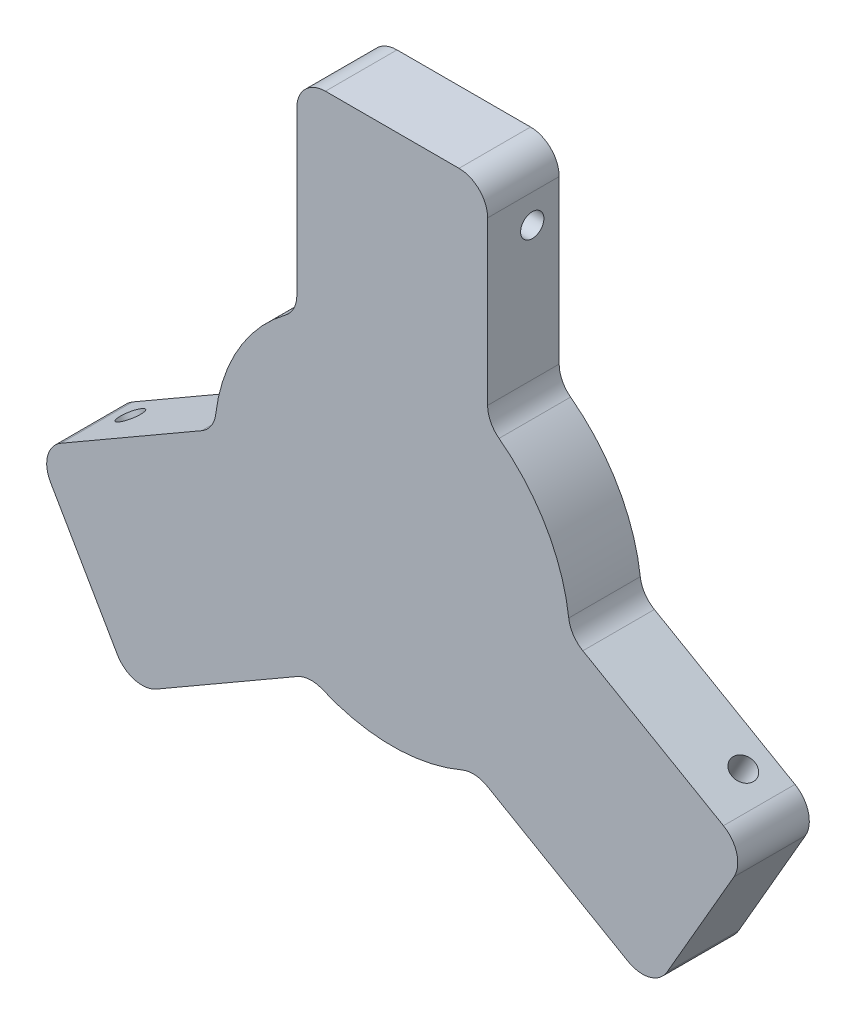
ISO-10303-21;
HEADER;
FILE_DESCRIPTION(('STEP AP214'),'2;1');
FILE_NAME('part.step','',(''),(''),'','','');
FILE_SCHEMA(('AUTOMOTIVE_DESIGN { 1 0 10303 214 1 1 1 1 }'));
ENDSEC;
DATA;
#1=APPLICATION_CONTEXT('core data for automotive mechanical design processes');
#2=APPLICATION_PROTOCOL_DEFINITION('international standard','automotive_design',2000,#1);
#3=PRODUCT_CONTEXT('',#1,'mechanical');
#4=PRODUCT('Part','Part','',(#3));
#5=PRODUCT_RELATED_PRODUCT_CATEGORY('part','',(#4));
#6=PRODUCT_DEFINITION_FORMATION('','',#4);
#7=PRODUCT_DEFINITION_CONTEXT('part definition',#1,'design');
#8=PRODUCT_DEFINITION('design','',#6,#7);
#9=PRODUCT_DEFINITION_SHAPE('','',#8);
#10=(LENGTH_UNIT() NAMED_UNIT(*) SI_UNIT(.MILLI.,.METRE.));
#11=(NAMED_UNIT(*) PLANE_ANGLE_UNIT() SI_UNIT($,.RADIAN.));
#12=(NAMED_UNIT(*) SI_UNIT($,.STERADIAN.) SOLID_ANGLE_UNIT());
#13=UNCERTAINTY_MEASURE_WITH_UNIT(LENGTH_MEASURE(1.E-05),#10,'distance_accuracy_value','');
#14=(GEOMETRIC_REPRESENTATION_CONTEXT(3) GLOBAL_UNCERTAINTY_ASSIGNED_CONTEXT((#13)) GLOBAL_UNIT_ASSIGNED_CONTEXT((#10,
#11,#12)) REPRESENTATION_CONTEXT('',''));
#15=CARTESIAN_POINT('',(0.,0.,0.));
#16=DIRECTION('',(0.,0.,1.));
#17=DIRECTION('',(1.,0.,0.));
#18=AXIS2_PLACEMENT_3D('',#15,#16,#17);
#19=CARTESIAN_POINT('',(-16.51,21.96907979331,9.525));
#20=DIRECTION('',(0.,0.,-1.));
#21=DIRECTION('',(-1.,0.,0.));
#22=AXIS2_PLACEMENT_3D('',#19,#20,#21);
#23=CYLINDRICAL_SURFACE('',#22,3.81);
#24=CARTESIAN_POINT('',(-16.51,21.96907979331,0.));
#25=DIRECTION('',(0.,0.,-1.));
#26=DIRECTION('',(-1.,0.,0.));
#27=AXIS2_PLACEMENT_3D('',#24,#25,#26);
#28=CIRCLE('',#27,3.81);
#29=CARTESIAN_POINT('',(-12.7,21.96907979331,0.));
#30=VERTEX_POINT('',#29);
#31=CARTESIAN_POINT('',(-14.2210561210812,18.9232899254496,0.));
#32=VERTEX_POINT('',#31);
#33=EDGE_CURVE('E227',#30,#32,#28,.T.);
#34=ORIENTED_EDGE('',*,*,#33,.T.);
#35=DIRECTION('',(0.,0.,-1.));
#36=VECTOR('',#35,1.);
#37=CARTESIAN_POINT('',(-14.2210561210812,18.9232899254496,9.525));
#38=LINE('',#37,#36);
#39=CARTESIAN_POINT('',(-14.2210561210812,18.9232899254496,9.525));
#40=VERTEX_POINT('',#39);
#41=EDGE_CURVE('E11',#40,#32,#38,.T.);
#42=ORIENTED_EDGE('',*,*,#41,.F.);
#43=CARTESIAN_POINT('',(-16.51,21.96907979331,9.525));
#44=DIRECTION('',(0.,0.,-1.));
#45=DIRECTION('',(-1.,0.,0.));
#46=AXIS2_PLACEMENT_3D('',#43,#44,#45);
#47=CIRCLE('',#46,3.81);
#48=CARTESIAN_POINT('',(-12.7,21.96907979331,9.525));
#49=VERTEX_POINT('',#48);
#50=EDGE_CURVE('E274',#49,#40,#47,.T.);
#51=ORIENTED_EDGE('',*,*,#50,.F.);
#52=DIRECTION('',(0.,0.,-1.));
#53=VECTOR('',#52,1.);
#54=CARTESIAN_POINT('',(-12.7,21.96907979331,9.525));
#55=LINE('',#54,#53);
#56=EDGE_CURVE('E223',#49,#30,#55,.T.);
#57=ORIENTED_EDGE('',*,*,#56,.T.);
#58=EDGE_LOOP('',(#34,#42,#51,#57));
#59=FACE_BOUND('',#58,.T.);
#60=ADVANCED_FACE('F35',(#59),#23,.F.);
#61=CARTESIAN_POINT('',(0.,0.,9.525));
#62=DIRECTION('',(0.,0.,-1.));
#63=DIRECTION('',(-1.,0.,0.));
#64=AXIS2_PLACEMENT_3D('',#61,#62,#63);
#65=CYLINDRICAL_SURFACE('',#64,23.6712766618441);
#66=CARTESIAN_POINT('',(0.,0.,0.));
#67=DIRECTION('',(0.,0.,1.));
#68=DIRECTION('',(1.,0.,0.));
#69=AXIS2_PLACEMENT_3D('',#66,#67,#68);
#70=CIRCLE('',#69,23.6712766618441);
#71=CARTESIAN_POINT('',(-23.4985778591582,2.85415090677404,0.));
#72=VERTEX_POINT('',#71);
#73=EDGE_CURVE('E230',#32,#72,#70,.T.);
#74=ORIENTED_EDGE('',*,*,#73,.T.);
#75=DIRECTION('',(0.,0.,-1.));
#76=VECTOR('',#75,1.);
#77=CARTESIAN_POINT('',(-23.4985778591582,2.85415090677404,9.525));
#78=LINE('',#77,#76);
#79=CARTESIAN_POINT('',(-23.4985778591582,2.85415090677404,9.525));
#80=VERTEX_POINT('',#79);
#81=EDGE_CURVE('E43',#80,#72,#78,.T.);
#82=ORIENTED_EDGE('',*,*,#81,.F.);
#83=CARTESIAN_POINT('',(0.,0.,9.525));
#84=DIRECTION('',(0.,0.,1.));
#85=DIRECTION('',(1.,0.,0.));
#86=AXIS2_PLACEMENT_3D('',#83,#84,#85);
#87=CIRCLE('',#86,23.6712766618441);
#88=EDGE_CURVE('E142',#40,#80,#87,.T.);
#89=ORIENTED_EDGE('',*,*,#88,.F.);
#90=ORIENTED_EDGE('',*,*,#41,.T.);
#91=EDGE_LOOP('',(#74,#82,#89,#90));
#92=FACE_BOUND('',#91,.T.);
#93=ADVANCED_FACE('F414',(#92),#65,.T.);
#94=CARTESIAN_POINT('',(-27.2807811987738,3.31353951982411,9.525));
#95=DIRECTION('',(0.,0.,-1.));
#96=DIRECTION('',(-1.,0.,0.));
#97=AXIS2_PLACEMENT_3D('',#94,#95,#96);
#98=CYLINDRICAL_SURFACE('',#97,3.81);
#99=CARTESIAN_POINT('',(-27.2807811987738,3.31353951982411,0.));
#100=DIRECTION('',(0.,0.,-1.));
#101=DIRECTION('',(1.,0.,0.));
#102=AXIS2_PLACEMENT_3D('',#99,#100,#101);
#103=CIRCLE('',#102,3.81);
#104=CARTESIAN_POINT('',(-25.3757811987738,0.0139827314054003,0.));
#105=VERTEX_POINT('',#104);
#106=EDGE_CURVE('E233',#72,#105,#103,.T.);
#107=ORIENTED_EDGE('',*,*,#106,.T.);
#108=DIRECTION('',(0.,0.,-1.));
#109=VECTOR('',#108,1.);
#110=CARTESIAN_POINT('',(-25.3757811987738,0.0139827314054003,9.525));
#111=LINE('',#110,#109);
#112=CARTESIAN_POINT('',(-25.3757811987738,0.0139827314054003,9.525));
#113=VERTEX_POINT('',#112);
#114=EDGE_CURVE('E329',#113,#105,#111,.T.);
#115=ORIENTED_EDGE('',*,*,#114,.F.);
#116=CARTESIAN_POINT('',(-27.2807811987738,3.31353951982411,9.525));
#117=DIRECTION('',(0.,0.,-1.));
#118=DIRECTION('',(1.,0.,0.));
#119=AXIS2_PLACEMENT_3D('',#116,#117,#118);
#120=CIRCLE('',#119,3.81);
#121=EDGE_CURVE('E337',#80,#113,#120,.T.);
#122=ORIENTED_EDGE('',*,*,#121,.F.);
#123=ORIENTED_EDGE('',*,*,#81,.T.);
#124=EDGE_LOOP('',(#107,#115,#122,#123));
#125=FACE_BOUND('',#124,.T.);
#126=ADVANCED_FACE('F335',(#125),#98,.F.);
#127=CARTESIAN_POINT('',(-25.3757811987738,0.0139827314054003,9.525));
#128=DIRECTION('',(0.5,-0.866025403784439,0.));
#129=DIRECTION('',(0.866025403784439,0.5,0.));
#130=AXIS2_PLACEMENT_3D('',#127,#128,#129);
#131=PLANE('',#130);
#132=CARTESIAN_POINT('',(-40.7973728710933,-8.88967737193932,3.58200000000159));
#133=DIRECTION('',(-0.500000000000029,0.866025403784422,0.));
#134=DIRECTION('',(-0.866025403784422,-0.500000000000029,0.));
#135=AXIS2_PLACEMENT_3D('',#132,#133,#134);
#136=CIRCLE('',#135,1.54999999999965);
#137=CARTESIAN_POINT('',(-42.1397122469589,-9.66467737193919,3.58200000000159));
#138=VERTEX_POINT('',#137);
#139=EDGE_CURVE('E697',#138,#138,#136,.T.);
#140=ORIENTED_EDGE('',*,*,#139,.F.);
#141=EDGE_LOOP('',(#140));
#142=FACE_BOUND('',#141,.T.);
#143=DIRECTION('',(-0.866025403784439,-0.5,0.));
#144=VECTOR('',#143,1.);
#145=CARTESIAN_POINT('',(-25.3757811987738,0.0139827314054003,0.));
#146=LINE('',#145,#144);
#147=CARTESIAN_POINT('',(-44.0969296595093,-10.7946773719391,0.));
#148=VERTEX_POINT('',#147);
#149=EDGE_CURVE('E235',#105,#148,#146,.T.);
#150=ORIENTED_EDGE('',*,*,#149,.T.);
#151=DIRECTION('',(0.,0.,-1.));
#152=VECTOR('',#151,1.);
#153=CARTESIAN_POINT('',(-44.0969296595093,-10.7946773719391,9.525));
#154=LINE('',#153,#152);
#155=CARTESIAN_POINT('',(-44.0969296595093,-10.7946773719391,9.525));
#156=VERTEX_POINT('',#155);
#157=EDGE_CURVE('E326',#156,#148,#154,.T.);
#158=ORIENTED_EDGE('',*,*,#157,.F.);
#159=DIRECTION('',(-0.866025403784439,-0.5,0.));
#160=VECTOR('',#159,1.);
#161=CARTESIAN_POINT('',(-25.3757811987738,0.0139827314054003,9.525));
#162=LINE('',#161,#160);
#163=EDGE_CURVE('E355',#113,#156,#162,.T.);
#164=ORIENTED_EDGE('',*,*,#163,.F.);
#165=ORIENTED_EDGE('',*,*,#114,.T.);
#166=EDGE_LOOP('',(#150,#158,#164,#165));
#167=FACE_BOUND('',#166,.T.);
#168=ADVANCED_FACE('F346',(#142,#167),#131,.F.);
#169=CARTESIAN_POINT('',(-42.1919296595093,-14.0942341603579,9.525));
#170=DIRECTION('',(0.,0.,-1.));
#171=DIRECTION('',(-1.,0.,0.));
#172=AXIS2_PLACEMENT_3D('',#169,#170,#171);
#173=CYLINDRICAL_SURFACE('',#172,3.81);
#174=CARTESIAN_POINT('',(-42.1919296595093,-14.0942341603579,0.));
#175=DIRECTION('',(0.,0.,1.));
#176=DIRECTION('',(1.,0.,0.));
#177=AXIS2_PLACEMENT_3D('',#174,#175,#176);
#178=CIRCLE('',#177,3.81);
#179=CARTESIAN_POINT('',(-45.491486447928,-15.9992341603579,0.));
#180=VERTEX_POINT('',#179);
#181=EDGE_CURVE('E237',#148,#180,#178,.T.);
#182=ORIENTED_EDGE('',*,*,#181,.T.);
#183=DIRECTION('',(0.,0.,-1.));
#184=VECTOR('',#183,1.);
#185=CARTESIAN_POINT('',(-45.491486447928,-15.9992341603579,9.525));
#186=LINE('',#185,#184);
#187=CARTESIAN_POINT('',(-45.491486447928,-15.9992341603579,9.525));
#188=VERTEX_POINT('',#187);
#189=EDGE_CURVE('E323',#188,#180,#186,.T.);
#190=ORIENTED_EDGE('',*,*,#189,.F.);
#191=CARTESIAN_POINT('',(-42.1919296595093,-14.0942341603579,9.525));
#192=DIRECTION('',(0.,0.,1.));
#193=DIRECTION('',(1.,0.,0.));
#194=AXIS2_PLACEMENT_3D('',#191,#192,#193);
#195=CIRCLE('',#194,3.81);
#196=EDGE_CURVE('E352',#156,#188,#195,.T.);
#197=ORIENTED_EDGE('',*,*,#196,.F.);
#198=ORIENTED_EDGE('',*,*,#157,.T.);
#199=EDGE_LOOP('',(#182,#190,#197,#198));
#200=FACE_BOUND('',#199,.T.);
#201=ADVANCED_FACE('F350',(#200),#173,.T.);
#202=CARTESIAN_POINT('',(-45.491486447928,-15.9992341603579,9.525));
#203=DIRECTION('',(0.866025403784438,0.5,0.));
#204=DIRECTION('',(-0.5,0.866025403784438,0.));
#205=AXIS2_PLACEMENT_3D('',#202,#203,#204);
#206=PLANE('',#205);
#207=DIRECTION('',(0.5,-0.866025403784438,0.));
#208=VECTOR('',#207,1.);
#209=CARTESIAN_POINT('',(-45.491486447928,-15.9992341603579,0.));
#210=LINE('',#209,#208);
#211=CARTESIAN_POINT('',(-36.601486447928,-31.3971658396452,0.));
#212=VERTEX_POINT('',#211);
#213=EDGE_CURVE('E239',#180,#212,#210,.T.);
#214=ORIENTED_EDGE('',*,*,#213,.T.);
#215=DIRECTION('',(0.,0.,-1.));
#216=VECTOR('',#215,1.);
#217=CARTESIAN_POINT('',(-36.601486447928,-31.3971658396452,9.525));
#218=LINE('',#217,#216);
#219=CARTESIAN_POINT('',(-36.601486447928,-31.3971658396452,9.525));
#220=VERTEX_POINT('',#219);
#221=EDGE_CURVE('E320',#220,#212,#218,.T.);
#222=ORIENTED_EDGE('',*,*,#221,.F.);
#223=DIRECTION('',(0.5,-0.866025403784438,0.));
#224=VECTOR('',#223,1.);
#225=CARTESIAN_POINT('',(-45.491486447928,-15.9992341603579,9.525));
#226=LINE('',#225,#224);
#227=EDGE_CURVE('E354',#188,#220,#226,.T.);
#228=ORIENTED_EDGE('',*,*,#227,.F.);
#229=ORIENTED_EDGE('',*,*,#189,.T.);
#230=EDGE_LOOP('',(#214,#222,#228,#229));
#231=FACE_BOUND('',#230,.T.);
#232=ADVANCED_FACE('F428',(#231),#206,.F.);
#233=CARTESIAN_POINT('',(-33.3019296595093,-29.4921658396452,9.525));
#234=DIRECTION('',(0.,0.,-1.));
#235=DIRECTION('',(-1.,0.,0.));
#236=AXIS2_PLACEMENT_3D('',#233,#234,#235);
#237=CYLINDRICAL_SURFACE('',#236,3.81);
#238=CARTESIAN_POINT('',(-33.3019296595093,-29.4921658396452,0.));
#239=DIRECTION('',(0.,0.,1.));
#240=DIRECTION('',(-1.,0.,0.));
#241=AXIS2_PLACEMENT_3D('',#238,#239,#240);
#242=CIRCLE('',#241,3.81);
#243=CARTESIAN_POINT('',(-31.3969296595093,-32.7917226280639,0.));
#244=VERTEX_POINT('',#243);
#245=EDGE_CURVE('E241',#212,#244,#242,.T.);
#246=ORIENTED_EDGE('',*,*,#245,.T.);
#247=DIRECTION('',(0.,0.,-1.));
#248=VECTOR('',#247,1.);
#249=CARTESIAN_POINT('',(-31.3969296595093,-32.7917226280639,9.525));
#250=LINE('',#249,#248);
#251=CARTESIAN_POINT('',(-31.3969296595093,-32.7917226280639,9.525));
#252=VERTEX_POINT('',#251);
#253=EDGE_CURVE('E317',#252,#244,#250,.T.);
#254=ORIENTED_EDGE('',*,*,#253,.F.);
#255=CARTESIAN_POINT('',(-33.3019296595093,-29.4921658396452,9.525));
#256=DIRECTION('',(0.,0.,1.));
#257=DIRECTION('',(-1.,0.,0.));
#258=AXIS2_PLACEMENT_3D('',#255,#256,#257);
#259=CIRCLE('',#258,3.81);
#260=EDGE_CURVE('E357',#220,#252,#259,.T.);
#261=ORIENTED_EDGE('',*,*,#260,.F.);
#262=ORIENTED_EDGE('',*,*,#221,.T.);
#263=EDGE_LOOP('',(#246,#254,#261,#262));
#264=FACE_BOUND('',#263,.T.);
#265=ADVANCED_FACE('F431',(#264),#237,.T.);
#266=CARTESIAN_POINT('',(-12.6757811987716,-21.9830625247181,9.525));
#267=DIRECTION('',(-0.5,0.866025403784439,0.));
#268=DIRECTION('',(-0.866025403784439,-0.5,0.));
#269=AXIS2_PLACEMENT_3D('',#266,#267,#268);
#270=PLANE('',#269);
#271=CARTESIAN_POINT('',(-28.0973728710923,-30.8867226280636,3.58200000000159));
#272=DIRECTION('',(0.499999999999996,-0.866025403784441,0.));
#273=DIRECTION('',(0.866025403784441,0.499999999999996,0.));
#274=AXIS2_PLACEMENT_3D('',#271,#272,#273);
#275=CIRCLE('',#274,1.55000000000059);
#276=CARTESIAN_POINT('',(-26.7550334952259,-30.1117226280634,3.58200000000159));
#277=VERTEX_POINT('',#276);
#278=EDGE_CURVE('E682',#277,#277,#275,.T.);
#279=ORIENTED_EDGE('',*,*,#278,.F.);
#280=EDGE_LOOP('',(#279));
#281=FACE_BOUND('',#280,.T.);
#282=DIRECTION('',(0.866025403784439,0.5,0.));
#283=VECTOR('',#282,1.);
#284=CARTESIAN_POINT('',(-12.6757811987716,-21.9830625247181,0.));
#285=LINE('',#284,#283);
#286=CARTESIAN_POINT('',(-12.6757811987716,-21.9830625247181,0.));
#287=VERTEX_POINT('',#286);
#288=EDGE_CURVE('E243',#244,#287,#285,.T.);
#289=ORIENTED_EDGE('',*,*,#288,.T.);
#290=DIRECTION('',(0.,0.,-1.));
#291=VECTOR('',#290,1.);
#292=CARTESIAN_POINT('',(-12.6757811987716,-21.9830625247181,9.525));
#293=LINE('',#292,#291);
#294=CARTESIAN_POINT('',(-12.6757811987716,-21.9830625247181,9.525));
#295=VERTEX_POINT('',#294);
#296=EDGE_CURVE('E314',#295,#287,#293,.T.);
#297=ORIENTED_EDGE('',*,*,#296,.F.);
#298=DIRECTION('',(0.866025403784439,0.5,0.));
#299=VECTOR('',#298,1.);
#300=CARTESIAN_POINT('',(-12.6757811987716,-21.9830625247181,9.525));
#301=LINE('',#300,#299);
#302=EDGE_CURVE('E363',#252,#295,#301,.T.);
#303=ORIENTED_EDGE('',*,*,#302,.F.);
#304=ORIENTED_EDGE('',*,*,#253,.T.);
#305=EDGE_LOOP('',(#289,#297,#303,#304));
#306=FACE_BOUND('',#305,.T.);
#307=ADVANCED_FACE('F435',(#281,#306),#270,.F.);
#308=CARTESIAN_POINT('',(-10.7707811987716,-25.2826193131368,9.525));
#309=DIRECTION('',(0.,0.,-1.));
#310=DIRECTION('',(-1.,0.,0.));
#311=AXIS2_PLACEMENT_3D('',#308,#309,#310);
#312=CYLINDRICAL_SURFACE('',#311,3.81);
#313=CARTESIAN_POINT('',(-10.7707811987716,-25.2826193131368,0.));
#314=DIRECTION('',(0.,0.,-1.));
#315=DIRECTION('',(-1.,0.,0.));
#316=AXIS2_PLACEMENT_3D('',#313,#314,#315);
#317=CIRCLE('',#316,3.81);
#318=CARTESIAN_POINT('',(-9.27752173807504,-21.7774408322261,0.));
#319=VERTEX_POINT('',#318);
#320=EDGE_CURVE('E245',#287,#319,#317,.T.);
#321=ORIENTED_EDGE('',*,*,#320,.T.);
#322=DIRECTION('',(0.,0.,-1.));
#323=VECTOR('',#322,1.);
#324=CARTESIAN_POINT('',(-9.27752173807504,-21.7774408322261,9.525));
#325=LINE('',#324,#323);
#326=CARTESIAN_POINT('',(-9.27752173807504,-21.7774408322261,9.525));
#327=VERTEX_POINT('',#326);
#328=EDGE_CURVE('E311',#327,#319,#325,.T.);
#329=ORIENTED_EDGE('',*,*,#328,.F.);
#330=CARTESIAN_POINT('',(-10.7707811987716,-25.2826193131368,9.525));
#331=DIRECTION('',(0.,0.,-1.));
#332=DIRECTION('',(-1.,0.,0.));
#333=AXIS2_PLACEMENT_3D('',#330,#331,#332);
#334=CIRCLE('',#333,3.81);
#335=EDGE_CURVE('E365',#295,#327,#334,.T.);
#336=ORIENTED_EDGE('',*,*,#335,.F.);
#337=ORIENTED_EDGE('',*,*,#296,.T.);
#338=EDGE_LOOP('',(#321,#329,#336,#337));
#339=FACE_BOUND('',#338,.T.);
#340=ADVANCED_FACE('F439',(#339),#312,.F.);
#341=CARTESIAN_POINT('',(0.,0.,9.525));
#342=DIRECTION('',(0.,0.,-1.));
#343=DIRECTION('',(-1.,0.,0.));
#344=AXIS2_PLACEMENT_3D('',#341,#342,#343);
#345=CYLINDRICAL_SURFACE('',#344,23.6712766618441);
#346=CARTESIAN_POINT('',(0.,0.,0.));
#347=DIRECTION('',(0.,0.,1.));
#348=DIRECTION('',(1.,0.,0.));
#349=AXIS2_PLACEMENT_3D('',#346,#347,#348);
#350=CIRCLE('',#349,23.6712766618441);
#351=CARTESIAN_POINT('',(9.27752173807691,-21.7774408322254,0.));
#352=VERTEX_POINT('',#351);
#353=EDGE_CURVE('E247',#319,#352,#350,.T.);
#354=ORIENTED_EDGE('',*,*,#353,.T.);
#355=DIRECTION('',(0.,0.,-1.));
#356=VECTOR('',#355,1.);
#357=CARTESIAN_POINT('',(9.27752173807691,-21.7774408322254,9.525));
#358=LINE('',#357,#356);
#359=CARTESIAN_POINT('',(9.27752173807691,-21.7774408322254,9.525));
#360=VERTEX_POINT('',#359);
#361=EDGE_CURVE('E308',#360,#352,#358,.T.);
#362=ORIENTED_EDGE('',*,*,#361,.F.);
#363=CARTESIAN_POINT('',(0.,0.,9.525));
#364=DIRECTION('',(0.,0.,1.));
#365=DIRECTION('',(1.,0.,0.));
#366=AXIS2_PLACEMENT_3D('',#363,#364,#365);
#367=CIRCLE('',#366,23.6712766618441);
#368=EDGE_CURVE('E367',#327,#360,#367,.T.);
#369=ORIENTED_EDGE('',*,*,#368,.F.);
#370=ORIENTED_EDGE('',*,*,#328,.T.);
#371=EDGE_LOOP('',(#354,#362,#369,#370));
#372=FACE_BOUND('',#371,.T.);
#373=ADVANCED_FACE('F443',(#372),#345,.T.);
#374=CARTESIAN_POINT('',(10.7707811987738,-25.2826193131361,9.525));
#375=DIRECTION('',(0.,0.,-1.));
#376=DIRECTION('',(-1.,0.,0.));
#377=AXIS2_PLACEMENT_3D('',#374,#375,#376);
#378=CYLINDRICAL_SURFACE('',#377,3.81);
#379=CARTESIAN_POINT('',(10.7707811987738,-25.2826193131361,0.));
#380=DIRECTION('',(0.,0.,-1.));
#381=DIRECTION('',(1.,0.,0.));
#382=AXIS2_PLACEMENT_3D('',#379,#380,#381);
#383=CIRCLE('',#382,3.81);
#384=CARTESIAN_POINT('',(12.6757811987738,-21.9830625247174,0.));
#385=VERTEX_POINT('',#384);
#386=EDGE_CURVE('E249',#352,#385,#383,.T.);
#387=ORIENTED_EDGE('',*,*,#386,.T.);
#388=DIRECTION('',(0.,0.,-1.));
#389=VECTOR('',#388,1.);
#390=CARTESIAN_POINT('',(12.6757811987738,-21.9830625247174,9.525));
#391=LINE('',#390,#389);
#392=CARTESIAN_POINT('',(12.6757811987738,-21.9830625247174,9.525));
#393=VERTEX_POINT('',#392);
#394=EDGE_CURVE('E305',#393,#385,#391,.T.);
#395=ORIENTED_EDGE('',*,*,#394,.F.);
#396=CARTESIAN_POINT('',(10.7707811987738,-25.2826193131361,9.525));
#397=DIRECTION('',(0.,0.,-1.));
#398=DIRECTION('',(1.,0.,0.));
#399=AXIS2_PLACEMENT_3D('',#396,#397,#398);
#400=CIRCLE('',#399,3.81);
#401=EDGE_CURVE('E369',#360,#393,#400,.T.);
#402=ORIENTED_EDGE('',*,*,#401,.F.);
#403=ORIENTED_EDGE('',*,*,#361,.T.);
#404=EDGE_LOOP('',(#387,#395,#402,#403));
#405=FACE_BOUND('',#404,.T.);
#406=ADVANCED_FACE('F447',(#405),#378,.F.);
#407=CARTESIAN_POINT('',(12.6757811987738,-21.9830625247174,9.525));
#408=DIRECTION('',(0.499999999999967,0.866025403784457,0.));
#409=DIRECTION('',(-0.866025403784458,0.499999999999968,0.));
#410=AXIS2_PLACEMENT_3D('',#407,#408,#409);
#411=PLANE('',#410);
#412=CARTESIAN_POINT('',(28.0973728710939,-30.8867226280631,3.58200000000159));
#413=DIRECTION('',(-0.499999999999968,-0.866025403784458,0.));
#414=DIRECTION('',(0.866025403784458,-0.499999999999968,0.));
#415=AXIS2_PLACEMENT_3D('',#412,#413,#414);
#416=CIRCLE('',#415,1.54999999999965);
#417=CARTESIAN_POINT('',(29.4397122469595,-31.6617226280629,3.58200000000159));
#418=VERTEX_POINT('',#417);
#419=EDGE_CURVE('E709',#418,#418,#416,.T.);
#420=ORIENTED_EDGE('',*,*,#419,.F.);
#421=EDGE_LOOP('',(#420));
#422=FACE_BOUND('',#421,.T.);
#423=DIRECTION('',(0.866025403784457,-0.499999999999967,0.));
#424=VECTOR('',#423,1.);
#425=CARTESIAN_POINT('',(12.6757811987738,-21.9830625247174,0.));
#426=LINE('',#425,#424);
#427=CARTESIAN_POINT('',(31.3969296595118,-32.7917226280624,0.));
#428=VERTEX_POINT('',#427);
#429=EDGE_CURVE('E251',#385,#428,#426,.T.);
#430=ORIENTED_EDGE('',*,*,#429,.T.);
#431=DIRECTION('',(0.,0.,-1.));
#432=VECTOR('',#431,1.);
#433=CARTESIAN_POINT('',(31.3969296595118,-32.7917226280624,9.525));
#434=LINE('',#433,#432);
#435=CARTESIAN_POINT('',(31.3969296595118,-32.7917226280624,9.525));
#436=VERTEX_POINT('',#435);
#437=EDGE_CURVE('E302',#436,#428,#434,.T.);
#438=ORIENTED_EDGE('',*,*,#437,.F.);
#439=DIRECTION('',(0.866025403784457,-0.499999999999967,0.));
#440=VECTOR('',#439,1.);
#441=CARTESIAN_POINT('',(12.6757811987738,-21.9830625247174,9.525));
#442=LINE('',#441,#440);
#443=EDGE_CURVE('E371',#393,#436,#442,.T.);
#444=ORIENTED_EDGE('',*,*,#443,.F.);
#445=ORIENTED_EDGE('',*,*,#394,.T.);
#446=EDGE_LOOP('',(#430,#438,#444,#445));
#447=FACE_BOUND('',#446,.T.);
#448=ADVANCED_FACE('F451',(#422,#447),#411,.F.);
#449=CARTESIAN_POINT('',(33.3019296595118,-29.4921658396437,9.525));
#450=DIRECTION('',(0.,0.,-1.));
#451=DIRECTION('',(-1.,0.,0.));
#452=AXIS2_PLACEMENT_3D('',#449,#450,#451);
#453=CYLINDRICAL_SURFACE('',#452,3.80999999999999);
#454=CARTESIAN_POINT('',(33.3019296595118,-29.4921658396437,0.));
#455=DIRECTION('',(0.,0.,1.));
#456=DIRECTION('',(1.,0.,0.));
#457=AXIS2_PLACEMENT_3D('',#454,#455,#456);
#458=CIRCLE('',#457,3.80999999999999);
#459=CARTESIAN_POINT('',(36.6014864479305,-31.3971658396437,0.));
#460=VERTEX_POINT('',#459);
#461=EDGE_CURVE('E253',#428,#460,#458,.T.);
#462=ORIENTED_EDGE('',*,*,#461,.T.);
#463=DIRECTION('',(0.,0.,-1.));
#464=VECTOR('',#463,1.);
#465=CARTESIAN_POINT('',(36.6014864479305,-31.3971658396437,9.525));
#466=LINE('',#465,#464);
#467=CARTESIAN_POINT('',(36.6014864479305,-31.3971658396437,9.525));
#468=VERTEX_POINT('',#467);
#469=EDGE_CURVE('E299',#468,#460,#466,.T.);
#470=ORIENTED_EDGE('',*,*,#469,.F.);
#471=CARTESIAN_POINT('',(33.3019296595118,-29.4921658396437,9.525));
#472=DIRECTION('',(0.,0.,1.));
#473=DIRECTION('',(1.,0.,0.));
#474=AXIS2_PLACEMENT_3D('',#471,#472,#473);
#475=CIRCLE('',#474,3.80999999999999);
#476=EDGE_CURVE('E373',#436,#468,#475,.T.);
#477=ORIENTED_EDGE('',*,*,#476,.F.);
#478=ORIENTED_EDGE('',*,*,#437,.T.);
#479=EDGE_LOOP('',(#462,#470,#477,#478));
#480=FACE_BOUND('',#479,.T.);
#481=ADVANCED_FACE('F455',(#480),#453,.T.);
#482=CARTESIAN_POINT('',(36.6014864479305,-31.3971658396437,9.525));
#483=DIRECTION('',(-0.866025403784439,0.5,0.));
#484=DIRECTION('',(-0.5,-0.866025403784439,0.));
#485=AXIS2_PLACEMENT_3D('',#482,#483,#484);
#486=PLANE('',#485);
#487=DIRECTION('',(0.5,0.866025403784439,0.));
#488=VECTOR('',#487,1.);
#489=CARTESIAN_POINT('',(36.6014864479305,-31.3971658396437,0.));
#490=LINE('',#489,#488);
#491=CARTESIAN_POINT('',(45.4914864479305,-15.9992341603564,0.));
#492=VERTEX_POINT('',#491);
#493=EDGE_CURVE('E255',#460,#492,#490,.T.);
#494=ORIENTED_EDGE('',*,*,#493,.T.);
#495=DIRECTION('',(0.,0.,-1.));
#496=VECTOR('',#495,1.);
#497=CARTESIAN_POINT('',(45.4914864479305,-15.9992341603564,9.525));
#498=LINE('',#497,#496);
#499=CARTESIAN_POINT('',(45.4914864479305,-15.9992341603564,9.525));
#500=VERTEX_POINT('',#499);
#501=EDGE_CURVE('E296',#500,#492,#498,.T.);
#502=ORIENTED_EDGE('',*,*,#501,.F.);
#503=DIRECTION('',(0.5,0.866025403784439,0.));
#504=VECTOR('',#503,1.);
#505=CARTESIAN_POINT('',(36.6014864479305,-31.3971658396437,9.525));
#506=LINE('',#505,#504);
#507=EDGE_CURVE('E375',#468,#500,#506,.T.);
#508=ORIENTED_EDGE('',*,*,#507,.F.);
#509=ORIENTED_EDGE('',*,*,#469,.T.);
#510=EDGE_LOOP('',(#494,#502,#508,#509));
#511=FACE_BOUND('',#510,.T.);
#512=ADVANCED_FACE('F459',(#511),#486,.F.);
#513=CARTESIAN_POINT('',(42.1919296595118,-14.0942341603564,9.525));
#514=DIRECTION('',(0.,0.,-1.));
#515=DIRECTION('',(-1.,0.,0.));
#516=AXIS2_PLACEMENT_3D('',#513,#514,#515);
#517=CYLINDRICAL_SURFACE('',#516,3.80999999999999);
#518=CARTESIAN_POINT('',(42.1919296595118,-14.0942341603564,0.));
#519=DIRECTION('',(0.,0.,1.));
#520=DIRECTION('',(-1.,0.,0.));
#521=AXIS2_PLACEMENT_3D('',#518,#519,#520);
#522=CIRCLE('',#521,3.80999999999999);
#523=CARTESIAN_POINT('',(44.0969296595118,-10.7946773719377,0.));
#524=VERTEX_POINT('',#523);
#525=EDGE_CURVE('E257',#492,#524,#522,.T.);
#526=ORIENTED_EDGE('',*,*,#525,.T.);
#527=DIRECTION('',(0.,0.,-1.));
#528=VECTOR('',#527,1.);
#529=CARTESIAN_POINT('',(44.0969296595118,-10.7946773719377,9.525));
#530=LINE('',#529,#528);
#531=CARTESIAN_POINT('',(44.0969296595118,-10.7946773719377,9.525));
#532=VERTEX_POINT('',#531);
#533=EDGE_CURVE('E293',#532,#524,#530,.T.);
#534=ORIENTED_EDGE('',*,*,#533,.F.);
#535=CARTESIAN_POINT('',(42.1919296595118,-14.0942341603564,9.525));
#536=DIRECTION('',(0.,0.,1.));
#537=DIRECTION('',(-1.,0.,0.));
#538=AXIS2_PLACEMENT_3D('',#535,#536,#537);
#539=CIRCLE('',#538,3.80999999999999);
#540=EDGE_CURVE('E377',#500,#532,#539,.T.);
#541=ORIENTED_EDGE('',*,*,#540,.F.);
#542=ORIENTED_EDGE('',*,*,#501,.T.);
#543=EDGE_LOOP('',(#526,#534,#541,#542));
#544=FACE_BOUND('',#543,.T.);
#545=ADVANCED_FACE('F463',(#544),#517,.T.);
#546=CARTESIAN_POINT('',(25.3757811987735,0.0139827314085106,9.525));
#547=DIRECTION('',(-0.5,-0.866025403784439,0.));
#548=DIRECTION('',(0.866025403784439,-0.5,0.));
#549=AXIS2_PLACEMENT_3D('',#546,#547,#548);
#550=PLANE('',#549);
#551=CARTESIAN_POINT('',(40.797372871093,-8.88967737193764,3.58200000000159));
#552=DIRECTION('',(0.5,0.866025403784439,0.));
#553=DIRECTION('',(-0.866025403784439,0.5,0.));
#554=AXIS2_PLACEMENT_3D('',#551,#552,#553);
#555=CIRCLE('',#554,1.55000000000059);
#556=CARTESIAN_POINT('',(39.4550334952266,-8.11467737193735,3.58200000000159));
#557=VERTEX_POINT('',#556);
#558=EDGE_CURVE('E703',#557,#557,#555,.T.);
#559=ORIENTED_EDGE('',*,*,#558,.F.);
#560=EDGE_LOOP('',(#559));
#561=FACE_BOUND('',#560,.T.);
#562=DIRECTION('',(-0.866025403784439,0.5,0.));
#563=VECTOR('',#562,1.);
#564=CARTESIAN_POINT('',(25.3757811987735,0.0139827314085106,0.));
#565=LINE('',#564,#563);
#566=CARTESIAN_POINT('',(25.3757811987735,0.0139827314085089,0.));
#567=VERTEX_POINT('',#566);
#568=EDGE_CURVE('E259',#524,#567,#565,.T.);
#569=ORIENTED_EDGE('',*,*,#568,.T.);
#570=DIRECTION('',(0.,0.,-1.));
#571=VECTOR('',#570,1.);
#572=CARTESIAN_POINT('',(25.3757811987735,0.0139827314085089,9.525));
#573=LINE('',#572,#571);
#574=CARTESIAN_POINT('',(25.3757811987735,0.0139827314085089,9.525));
#575=VERTEX_POINT('',#574);
#576=EDGE_CURVE('E290',#575,#567,#573,.T.);
#577=ORIENTED_EDGE('',*,*,#576,.F.);
#578=DIRECTION('',(-0.866025403784439,0.5,0.));
#579=VECTOR('',#578,1.);
#580=CARTESIAN_POINT('',(25.3757811987735,0.0139827314085106,9.525));
#581=LINE('',#580,#579);
#582=EDGE_CURVE('E379',#532,#575,#581,.T.);
#583=ORIENTED_EDGE('',*,*,#582,.F.);
#584=ORIENTED_EDGE('',*,*,#533,.T.);
#585=EDGE_LOOP('',(#569,#577,#583,#584));
#586=FACE_BOUND('',#585,.T.);
#587=ADVANCED_FACE('F467',(#561,#586),#550,.F.);
#588=CARTESIAN_POINT('',(27.2807811987735,3.31353951982722,9.525));
#589=DIRECTION('',(0.,0.,-1.));
#590=DIRECTION('',(-1.,0.,0.));
#591=AXIS2_PLACEMENT_3D('',#588,#589,#590);
#592=CYLINDRICAL_SURFACE('',#591,3.81);
#593=CARTESIAN_POINT('',(27.2807811987735,3.31353951982722,0.));
#594=DIRECTION('',(0.,0.,-1.));
#595=DIRECTION('',(-1.,0.,0.));
#596=AXIS2_PLACEMENT_3D('',#593,#594,#595);
#597=CIRCLE('',#596,3.81);
#598=CARTESIAN_POINT('',(23.498577859158,2.85415090677673,0.));
#599=VERTEX_POINT('',#598);
#600=EDGE_CURVE('E261',#567,#599,#597,.T.);
#601=ORIENTED_EDGE('',*,*,#600,.T.);
#602=DIRECTION('',(0.,0.,-1.));
#603=VECTOR('',#602,1.);
#604=CARTESIAN_POINT('',(23.498577859158,2.85415090677673,9.525));
#605=LINE('',#604,#603);
#606=CARTESIAN_POINT('',(23.498577859158,2.85415090677673,9.525));
#607=VERTEX_POINT('',#606);
#608=EDGE_CURVE('E287',#607,#599,#605,.T.);
#609=ORIENTED_EDGE('',*,*,#608,.F.);
#610=CARTESIAN_POINT('',(27.2807811987735,3.31353951982722,9.525));
#611=DIRECTION('',(0.,0.,-1.));
#612=DIRECTION('',(-1.,0.,0.));
#613=AXIS2_PLACEMENT_3D('',#610,#611,#612);
#614=CIRCLE('',#613,3.81);
#615=EDGE_CURVE('E381',#575,#607,#614,.T.);
#616=ORIENTED_EDGE('',*,*,#615,.F.);
#617=ORIENTED_EDGE('',*,*,#576,.T.);
#618=EDGE_LOOP('',(#601,#609,#616,#617));
#619=FACE_BOUND('',#618,.T.);
#620=ADVANCED_FACE('F471',(#619),#592,.F.);
#621=CARTESIAN_POINT('',(0.,0.,9.525));
#622=DIRECTION('',(0.,0.,-1.));
#623=DIRECTION('',(-1.,0.,0.));
#624=AXIS2_PLACEMENT_3D('',#621,#622,#623);
#625=CYLINDRICAL_SURFACE('',#624,23.6712766618441);
#626=CARTESIAN_POINT('',(0.,0.,0.));
#627=DIRECTION('',(0.,0.,1.));
#628=DIRECTION('',(1.,0.,0.));
#629=AXIS2_PLACEMENT_3D('',#626,#627,#628);
#630=CIRCLE('',#629,23.6712766618441);
#631=CARTESIAN_POINT('',(14.2210561210813,18.9232899254497,0.));
#632=VERTEX_POINT('',#631);
#633=EDGE_CURVE('E263',#599,#632,#630,.T.);
#634=ORIENTED_EDGE('',*,*,#633,.T.);
#635=DIRECTION('',(0.,0.,-1.));
#636=VECTOR('',#635,1.);
#637=CARTESIAN_POINT('',(14.2210561210813,18.9232899254497,9.525));
#638=LINE('',#637,#636);
#639=CARTESIAN_POINT('',(14.2210561210813,18.9232899254497,9.525));
#640=VERTEX_POINT('',#639);
#641=EDGE_CURVE('E284',#640,#632,#638,.T.);
#642=ORIENTED_EDGE('',*,*,#641,.F.);
#643=CARTESIAN_POINT('',(0.,0.,9.525));
#644=DIRECTION('',(0.,0.,1.));
#645=DIRECTION('',(1.,0.,0.));
#646=AXIS2_PLACEMENT_3D('',#643,#644,#645);
#647=CIRCLE('',#646,23.6712766618441);
#648=EDGE_CURVE('E383',#607,#640,#647,.T.);
#649=ORIENTED_EDGE('',*,*,#648,.F.);
#650=ORIENTED_EDGE('',*,*,#608,.T.);
#651=EDGE_LOOP('',(#634,#642,#649,#650));
#652=FACE_BOUND('',#651,.T.);
#653=ADVANCED_FACE('F475',(#652),#625,.T.);
#654=CARTESIAN_POINT('',(16.51,21.96907979331,9.525));
#655=DIRECTION('',(0.,0.,-1.));
#656=DIRECTION('',(-1.,0.,0.));
#657=AXIS2_PLACEMENT_3D('',#654,#655,#656);
#658=CYLINDRICAL_SURFACE('',#657,3.81);
#659=CARTESIAN_POINT('',(16.51,21.96907979331,0.));
#660=DIRECTION('',(0.,0.,-1.));
#661=DIRECTION('',(1.,0.,0.));
#662=AXIS2_PLACEMENT_3D('',#659,#660,#661);
#663=CIRCLE('',#662,3.81);
#664=CARTESIAN_POINT('',(12.7,21.96907979331,0.));
#665=VERTEX_POINT('',#664);
#666=EDGE_CURVE('E265',#632,#665,#663,.T.);
#667=ORIENTED_EDGE('',*,*,#666,.T.);
#668=DIRECTION('',(0.,0.,-1.));
#669=VECTOR('',#668,1.);
#670=CARTESIAN_POINT('',(12.7,21.96907979331,9.525));
#671=LINE('',#670,#669);
#672=CARTESIAN_POINT('',(12.7,21.96907979331,9.525));
#673=VERTEX_POINT('',#672);
#674=EDGE_CURVE('E281',#673,#665,#671,.T.);
#675=ORIENTED_EDGE('',*,*,#674,.F.);
#676=CARTESIAN_POINT('',(16.51,21.96907979331,9.525));
#677=DIRECTION('',(0.,0.,-1.));
#678=DIRECTION('',(1.,0.,0.));
#679=AXIS2_PLACEMENT_3D('',#676,#677,#678);
#680=CIRCLE('',#679,3.81);
#681=EDGE_CURVE('E385',#640,#673,#680,.T.);
#682=ORIENTED_EDGE('',*,*,#681,.F.);
#683=ORIENTED_EDGE('',*,*,#641,.T.);
#684=EDGE_LOOP('',(#667,#675,#682,#683));
#685=FACE_BOUND('',#684,.T.);
#686=ADVANCED_FACE('F479',(#685),#658,.F.);
#687=CARTESIAN_POINT('',(12.7,21.96907979331,9.525));
#688=DIRECTION('',(-1.,0.,0.));
#689=DIRECTION('',(0.,-1.,0.));
#690=AXIS2_PLACEMENT_3D('',#687,#688,#689);
#691=PLANE('',#690);
#692=CARTESIAN_POINT('',(12.6999999999997,39.7764000000025,3.58200000000159));
#693=DIRECTION('',(1.,0.,0.));
#694=DIRECTION('',(0.,1.,0.));
#695=AXIS2_PLACEMENT_3D('',#692,#693,#694);
#696=CIRCLE('',#695,1.54999999999965);
#697=CARTESIAN_POINT('',(12.6999999999997,41.3264000000022,3.58200000000159));
#698=VERTEX_POINT('',#697);
#699=EDGE_CURVE('E692',#698,#698,#696,.T.);
#700=ORIENTED_EDGE('',*,*,#699,.F.);
#701=EDGE_LOOP('',(#700));
#702=FACE_BOUND('',#701,.T.);
#703=DIRECTION('',(0.,1.,0.));
#704=VECTOR('',#703,1.);
#705=CARTESIAN_POINT('',(12.7,21.96907979331,0.));
#706=LINE('',#705,#704);
#707=CARTESIAN_POINT('',(12.7,43.5864,0.));
#708=VERTEX_POINT('',#707);
#709=EDGE_CURVE('E267',#665,#708,#706,.T.);
#710=ORIENTED_EDGE('',*,*,#709,.T.);
#711=DIRECTION('',(0.,0.,-1.));
#712=VECTOR('',#711,1.);
#713=CARTESIAN_POINT('',(12.7,43.5864,9.525));
#714=LINE('',#713,#712);
#715=CARTESIAN_POINT('',(12.7,43.5864,9.525));
#716=VERTEX_POINT('',#715);
#717=EDGE_CURVE('E278',#716,#708,#714,.T.);
#718=ORIENTED_EDGE('',*,*,#717,.F.);
#719=DIRECTION('',(0.,1.,0.));
#720=VECTOR('',#719,1.);
#721=CARTESIAN_POINT('',(12.7,21.96907979331,9.525));
#722=LINE('',#721,#720);
#723=EDGE_CURVE('E387',#673,#716,#722,.T.);
#724=ORIENTED_EDGE('',*,*,#723,.F.);
#725=ORIENTED_EDGE('',*,*,#674,.T.);
#726=EDGE_LOOP('',(#710,#718,#724,#725));
#727=FACE_BOUND('',#726,.T.);
#728=ADVANCED_FACE('F393',(#702,#727),#691,.F.);
#729=CARTESIAN_POINT('',(8.88999999999998,43.5864,9.525));
#730=DIRECTION('',(0.,0.,-1.));
#731=DIRECTION('',(-1.,0.,0.));
#732=AXIS2_PLACEMENT_3D('',#729,#730,#731);
#733=CYLINDRICAL_SURFACE('',#732,3.81);
#734=CARTESIAN_POINT('',(8.88999999999998,43.5864,0.));
#735=DIRECTION('',(0.,0.,1.));
#736=DIRECTION('',(1.,0.,0.));
#737=AXIS2_PLACEMENT_3D('',#734,#735,#736);
#738=CIRCLE('',#737,3.81);
#739=CARTESIAN_POINT('',(8.88999999999995,47.3964,0.));
#740=VERTEX_POINT('',#739);
#741=EDGE_CURVE('E269',#708,#740,#738,.T.);
#742=ORIENTED_EDGE('',*,*,#741,.T.);
#743=DIRECTION('',(0.,0.,-1.));
#744=VECTOR('',#743,1.);
#745=CARTESIAN_POINT('',(8.88999999999995,47.3964,9.525));
#746=LINE('',#745,#744);
#747=CARTESIAN_POINT('',(8.88999999999995,47.3964,9.525));
#748=VERTEX_POINT('',#747);
#749=EDGE_CURVE('E218',#748,#740,#746,.T.);
#750=ORIENTED_EDGE('',*,*,#749,.F.);
#751=CARTESIAN_POINT('',(8.88999999999998,43.5864,9.525));
#752=DIRECTION('',(0.,0.,1.));
#753=DIRECTION('',(1.,0.,0.));
#754=AXIS2_PLACEMENT_3D('',#751,#752,#753);
#755=CIRCLE('',#754,3.81);
#756=EDGE_CURVE('E209',#716,#748,#755,.T.);
#757=ORIENTED_EDGE('',*,*,#756,.F.);
#758=ORIENTED_EDGE('',*,*,#717,.T.);
#759=EDGE_LOOP('',(#742,#750,#757,#758));
#760=FACE_BOUND('',#759,.T.);
#761=ADVANCED_FACE('F397',(#760),#733,.T.);
#762=CARTESIAN_POINT('',(8.88999999999995,47.3964,9.525));
#763=DIRECTION('',(0.,-1.,0.));
#764=DIRECTION('',(1.,0.,0.));
#765=AXIS2_PLACEMENT_3D('',#762,#763,#764);
#766=PLANE('',#765);
#767=DIRECTION('',(-1.,0.,0.));
#768=VECTOR('',#767,1.);
#769=CARTESIAN_POINT('',(8.88999999999995,47.3964,0.));
#770=LINE('',#769,#768);
#771=CARTESIAN_POINT('',(-8.88999999999999,47.3964,0.));
#772=VERTEX_POINT('',#771);
#773=EDGE_CURVE('E217',#740,#772,#770,.T.);
#774=ORIENTED_EDGE('',*,*,#773,.T.);
#775=DIRECTION('',(0.,0.,-1.));
#776=VECTOR('',#775,1.);
#777=CARTESIAN_POINT('',(-8.88999999999999,47.3964,9.525));
#778=LINE('',#777,#776);
#779=CARTESIAN_POINT('',(-8.88999999999999,47.3964,9.525));
#780=VERTEX_POINT('',#779);
#781=EDGE_CURVE('E214',#780,#772,#778,.T.);
#782=ORIENTED_EDGE('',*,*,#781,.F.);
#783=DIRECTION('',(-1.,0.,0.));
#784=VECTOR('',#783,1.);
#785=CARTESIAN_POINT('',(8.88999999999995,47.3964,9.525));
#786=LINE('',#785,#784);
#787=EDGE_CURVE('E203',#748,#780,#786,.T.);
#788=ORIENTED_EDGE('',*,*,#787,.F.);
#789=ORIENTED_EDGE('',*,*,#749,.T.);
#790=EDGE_LOOP('',(#774,#782,#788,#789));
#791=FACE_BOUND('',#790,.T.);
#792=ADVANCED_FACE('F215',(#791),#766,.F.);
#793=CARTESIAN_POINT('',(-8.89000000000002,43.5864,9.525));
#794=DIRECTION('',(0.,0.,-1.));
#795=DIRECTION('',(-1.,0.,0.));
#796=AXIS2_PLACEMENT_3D('',#793,#794,#795);
#797=CYLINDRICAL_SURFACE('',#796,3.81);
#798=CARTESIAN_POINT('',(-8.89000000000002,43.5864,0.));
#799=DIRECTION('',(0.,0.,1.));
#800=DIRECTION('',(1.,0.,0.));
#801=AXIS2_PLACEMENT_3D('',#798,#799,#800);
#802=CIRCLE('',#801,3.81);
#803=CARTESIAN_POINT('',(-12.7,43.5864,0.));
#804=VERTEX_POINT('',#803);
#805=EDGE_CURVE('E128',#772,#804,#802,.T.);
#806=ORIENTED_EDGE('',*,*,#805,.T.);
#807=DIRECTION('',(0.,0.,-1.));
#808=VECTOR('',#807,1.);
#809=CARTESIAN_POINT('',(-12.7,43.5864,9.525));
#810=LINE('',#809,#808);
#811=CARTESIAN_POINT('',(-12.7,43.5864,9.525));
#812=VERTEX_POINT('',#811);
#813=EDGE_CURVE('E219',#812,#804,#810,.T.);
#814=ORIENTED_EDGE('',*,*,#813,.F.);
#815=CARTESIAN_POINT('',(-8.89000000000002,43.5864,9.525));
#816=DIRECTION('',(0.,0.,1.));
#817=DIRECTION('',(1.,0.,0.));
#818=AXIS2_PLACEMENT_3D('',#815,#816,#817);
#819=CIRCLE('',#818,3.81);
#820=EDGE_CURVE('E207',#780,#812,#819,.T.);
#821=ORIENTED_EDGE('',*,*,#820,.F.);
#822=ORIENTED_EDGE('',*,*,#781,.T.);
#823=EDGE_LOOP('',(#806,#814,#821,#822));
#824=FACE_BOUND('',#823,.T.);
#825=ADVANCED_FACE('F221',(#824),#797,.T.);
#826=CARTESIAN_POINT('',(-12.7,21.96907979331,9.525));
#827=DIRECTION('',(1.,0.,0.));
#828=DIRECTION('',(0.,0.,-1.));
#829=AXIS2_PLACEMENT_3D('',#826,#827,#828);
#830=PLANE('',#829);
#831=CARTESIAN_POINT('',(-12.7000000000004,39.7764000000015,3.58200000000159));
#832=DIRECTION('',(-1.,0.,0.));
#833=DIRECTION('',(0.,-1.,0.));
#834=AXIS2_PLACEMENT_3D('',#831,#832,#833);
#835=CIRCLE('',#834,1.55000000000059);
#836=CARTESIAN_POINT('',(-12.7000000000004,38.2264000000009,3.58200000000159));
#837=VERTEX_POINT('',#836);
#838=EDGE_CURVE('E683',#837,#837,#835,.T.);
#839=ORIENTED_EDGE('',*,*,#838,.F.);
#840=EDGE_LOOP('',(#839));
#841=FACE_BOUND('',#840,.T.);
#842=DIRECTION('',(0.,-1.,0.));
#843=VECTOR('',#842,1.);
#844=CARTESIAN_POINT('',(-12.7,21.96907979331,0.));
#845=LINE('',#844,#843);
#846=EDGE_CURVE('E134',#804,#30,#845,.T.);
#847=ORIENTED_EDGE('',*,*,#846,.T.);
#848=ORIENTED_EDGE('',*,*,#56,.F.);
#849=DIRECTION('',(0.,-1.,0.));
#850=VECTOR('',#849,1.);
#851=CARTESIAN_POINT('',(-12.7,21.96907979331,9.525));
#852=LINE('',#851,#850);
#853=EDGE_CURVE('E51',#812,#49,#852,.T.);
#854=ORIENTED_EDGE('',*,*,#853,.F.);
#855=ORIENTED_EDGE('',*,*,#813,.T.);
#856=EDGE_LOOP('',(#847,#848,#854,#855));
#857=FACE_BOUND('',#856,.T.);
#858=ADVANCED_FACE('F401',(#841,#857),#830,.F.);
#859=CARTESIAN_POINT('',(-16.51,21.96907979331,9.525));
#860=DIRECTION('',(0.,0.,-1.));
#861=DIRECTION('',(-1.,0.,0.));
#862=AXIS2_PLACEMENT_3D('',#859,#860,#861);
#863=PLANE('',#862);
#864=ORIENTED_EDGE('',*,*,#50,.T.);
#865=ORIENTED_EDGE('',*,*,#88,.T.);
#866=ORIENTED_EDGE('',*,*,#121,.T.);
#867=ORIENTED_EDGE('',*,*,#163,.T.);
#868=ORIENTED_EDGE('',*,*,#196,.T.);
#869=ORIENTED_EDGE('',*,*,#227,.T.);
#870=ORIENTED_EDGE('',*,*,#260,.T.);
#871=ORIENTED_EDGE('',*,*,#302,.T.);
#872=ORIENTED_EDGE('',*,*,#335,.T.);
#873=ORIENTED_EDGE('',*,*,#368,.T.);
#874=ORIENTED_EDGE('',*,*,#401,.T.);
#875=ORIENTED_EDGE('',*,*,#443,.T.);
#876=ORIENTED_EDGE('',*,*,#476,.T.);
#877=ORIENTED_EDGE('',*,*,#507,.T.);
#878=ORIENTED_EDGE('',*,*,#540,.T.);
#879=ORIENTED_EDGE('',*,*,#582,.T.);
#880=ORIENTED_EDGE('',*,*,#615,.T.);
#881=ORIENTED_EDGE('',*,*,#648,.T.);
#882=ORIENTED_EDGE('',*,*,#681,.T.);
#883=ORIENTED_EDGE('',*,*,#723,.T.);
#884=ORIENTED_EDGE('',*,*,#756,.T.);
#885=ORIENTED_EDGE('',*,*,#787,.T.);
#886=ORIENTED_EDGE('',*,*,#820,.T.);
#887=ORIENTED_EDGE('',*,*,#853,.T.);
#888=EDGE_LOOP('',(#864,#865,#866,#867,#868,#869,#870,#871,#872,#873,#874,#875,#876,#877,#878,
#879,#880,#881,#882,#883,#884,#885,#886,#887));
#889=FACE_BOUND('',#888,.T.);
#890=ADVANCED_FACE('F205',(#889),#863,.F.);
#891=CARTESIAN_POINT('',(-16.51,21.96907979331,0.));
#892=DIRECTION('',(0.,0.,-1.));
#893=DIRECTION('',(-1.,0.,0.));
#894=AXIS2_PLACEMENT_3D('',#891,#892,#893);
#895=PLANE('',#894);
#896=ORIENTED_EDGE('',*,*,#33,.F.);
#897=ORIENTED_EDGE('',*,*,#846,.F.);
#898=ORIENTED_EDGE('',*,*,#805,.F.);
#899=ORIENTED_EDGE('',*,*,#773,.F.);
#900=ORIENTED_EDGE('',*,*,#741,.F.);
#901=ORIENTED_EDGE('',*,*,#709,.F.);
#902=ORIENTED_EDGE('',*,*,#666,.F.);
#903=ORIENTED_EDGE('',*,*,#633,.F.);
#904=ORIENTED_EDGE('',*,*,#600,.F.);
#905=ORIENTED_EDGE('',*,*,#568,.F.);
#906=ORIENTED_EDGE('',*,*,#525,.F.);
#907=ORIENTED_EDGE('',*,*,#493,.F.);
#908=ORIENTED_EDGE('',*,*,#461,.F.);
#909=ORIENTED_EDGE('',*,*,#429,.F.);
#910=ORIENTED_EDGE('',*,*,#386,.F.);
#911=ORIENTED_EDGE('',*,*,#353,.F.);
#912=ORIENTED_EDGE('',*,*,#320,.F.);
#913=ORIENTED_EDGE('',*,*,#288,.F.);
#914=ORIENTED_EDGE('',*,*,#245,.F.);
#915=ORIENTED_EDGE('',*,*,#213,.F.);
#916=ORIENTED_EDGE('',*,*,#181,.F.);
#917=ORIENTED_EDGE('',*,*,#149,.F.);
#918=ORIENTED_EDGE('',*,*,#106,.F.);
#919=ORIENTED_EDGE('',*,*,#73,.F.);
#920=EDGE_LOOP('',(#896,#897,#898,#899,#900,#901,#902,#903,#904,#905,#906,#907,#908,#909,#910,
#911,#912,#913,#914,#915,#916,#917,#918,#919));
#921=FACE_BOUND('',#920,.T.);
#922=ADVANCED_FACE('F341',(#921),#895,.T.);
#923=CARTESIAN_POINT('',(30.6373728710938,-26.4873135768381,3.58200000000159));
#924=DIRECTION('',(-0.499999999999967,-0.866025403784457,0.));
#925=DIRECTION('',(0.866025403784457,-0.499999999999967,0.));
#926=AXIS2_PLACEMENT_3D('',#923,#924,#925);
#927=CYLINDRICAL_SURFACE('',#926,1.54999999999965);
#928=CARTESIAN_POINT('',(30.6373728710938,-26.4873135768381,3.58200000000159));
#929=DIRECTION('',(-0.499999999999968,-0.866025403784458,0.));
#930=DIRECTION('',(0.866025403784458,-0.499999999999968,0.));
#931=AXIS2_PLACEMENT_3D('',#928,#929,#930);
#932=CIRCLE('',#931,1.54999999999965);
#933=CARTESIAN_POINT('',(31.9797122469594,-27.2623135768378,3.58200000000159));
#934=VERTEX_POINT('',#933);
#935=EDGE_CURVE('E231',#934,#934,#932,.T.);
#936=ORIENTED_EDGE('',*,*,#935,.F.);
#937=EDGE_LOOP('',(#936));
#938=FACE_BOUND('',#937,.T.);
#939=ORIENTED_EDGE('',*,*,#419,.T.);
#940=EDGE_LOOP('',(#939));
#941=FACE_BOUND('',#940,.T.);
#942=ADVANCED_FACE('F514',(#938,#941),#927,.F.);
#943=CARTESIAN_POINT('',(30.6373728710938,-26.4873135768381,3.58200000000159));
#944=DIRECTION('',(-0.499999999999968,-0.866025403784458,0.));
#945=DIRECTION('',(0.866025403784458,-0.499999999999968,0.));
#946=AXIS2_PLACEMENT_3D('',#943,#944,#945);
#947=PLANE('',#946);
#948=ORIENTED_EDGE('',*,*,#935,.T.);
#949=EDGE_LOOP('',(#948));
#950=FACE_BOUND('',#949,.T.);
#951=ADVANCED_FACE('F530',(#950),#947,.T.);
#952=CARTESIAN_POINT('',(38.257372871093,-13.2890864231626,3.58200000000159));
#953=DIRECTION('',(0.5,0.866025403784439,0.));
#954=DIRECTION('',(-0.866025403784439,0.5,0.));
#955=AXIS2_PLACEMENT_3D('',#952,#953,#954);
#956=CYLINDRICAL_SURFACE('',#955,1.55000000000059);
#957=CARTESIAN_POINT('',(38.257372871093,-13.2890864231626,3.58200000000159));
#958=DIRECTION('',(0.5,0.866025403784439,0.));
#959=DIRECTION('',(-0.866025403784439,0.5,0.));
#960=AXIS2_PLACEMENT_3D('',#957,#958,#959);
#961=CIRCLE('',#960,1.55000000000059);
#962=CARTESIAN_POINT('',(36.9150334952266,-12.5140864231623,3.58200000000159));
#963=VERTEX_POINT('',#962);
#964=EDGE_CURVE('E706',#963,#963,#961,.T.);
#965=ORIENTED_EDGE('',*,*,#964,.F.);
#966=EDGE_LOOP('',(#965));
#967=FACE_BOUND('',#966,.T.);
#968=ORIENTED_EDGE('',*,*,#558,.T.);
#969=EDGE_LOOP('',(#968));
#970=FACE_BOUND('',#969,.T.);
#971=ADVANCED_FACE('F540',(#967,#970),#956,.F.);
#972=CARTESIAN_POINT('',(38.257372871093,-13.2890864231626,3.58200000000159));
#973=DIRECTION('',(0.5,0.866025403784439,0.));
#974=DIRECTION('',(-0.866025403784439,0.5,0.));
#975=AXIS2_PLACEMENT_3D('',#972,#973,#974);
#976=PLANE('',#975);
#977=ORIENTED_EDGE('',*,*,#964,.T.);
#978=EDGE_LOOP('',(#977));
#979=FACE_BOUND('',#978,.T.);
#980=ADVANCED_FACE('F558',(#979),#976,.T.);
#981=CARTESIAN_POINT('',(-38.2573728710932,-13.2890864231642,3.58200000000159));
#982=DIRECTION('',(-0.500000000000029,0.866025403784422,0.));
#983=DIRECTION('',(-0.866025403784422,-0.500000000000029,0.));
#984=AXIS2_PLACEMENT_3D('',#981,#982,#983);
#985=CYLINDRICAL_SURFACE('',#984,1.54999999999965);
#986=CARTESIAN_POINT('',(-38.2573728710932,-13.2890864231642,3.58200000000159));
#987=DIRECTION('',(-0.500000000000029,0.866025403784422,0.));
#988=DIRECTION('',(-0.866025403784422,-0.500000000000029,0.));
#989=AXIS2_PLACEMENT_3D('',#986,#987,#988);
#990=CIRCLE('',#989,1.54999999999965);
#991=CARTESIAN_POINT('',(-39.5997122469587,-14.0640864231641,3.58200000000159));
#992=VERTEX_POINT('',#991);
#993=EDGE_CURVE('E700',#992,#992,#990,.T.);
#994=ORIENTED_EDGE('',*,*,#993,.F.);
#995=EDGE_LOOP('',(#994));
#996=FACE_BOUND('',#995,.T.);
#997=ORIENTED_EDGE('',*,*,#139,.T.);
#998=EDGE_LOOP('',(#997));
#999=FACE_BOUND('',#998,.T.);
#1000=ADVANCED_FACE('F568',(#996,#999),#985,.F.);
#1001=CARTESIAN_POINT('',(-38.2573728710932,-13.2890864231642,3.58200000000159));
#1002=DIRECTION('',(-0.500000000000029,0.866025403784422,0.));
#1003=DIRECTION('',(-0.866025403784422,-0.500000000000029,0.));
#1004=AXIS2_PLACEMENT_3D('',#1001,#1002,#1003);
#1005=PLANE('',#1004);
#1006=ORIENTED_EDGE('',*,*,#993,.T.);
#1007=EDGE_LOOP('',(#1006));
#1008=FACE_BOUND('',#1007,.T.);
#1009=ADVANCED_FACE('F605',(#1008),#1005,.T.);
#1010=CARTESIAN_POINT('',(7.61999999999971,39.7764000000024,3.58200000000159));
#1011=DIRECTION('',(1.,0.,0.));
#1012=DIRECTION('',(0.,1.,0.));
#1013=AXIS2_PLACEMENT_3D('',#1010,#1011,#1012);
#1014=CYLINDRICAL_SURFACE('',#1013,1.54999999999965);
#1015=CARTESIAN_POINT('',(7.61999999999971,39.7764000000024,3.58200000000159));
#1016=DIRECTION('',(1.,0.,0.));
#1017=DIRECTION('',(0.,1.,0.));
#1018=AXIS2_PLACEMENT_3D('',#1015,#1016,#1017);
#1019=CIRCLE('',#1018,1.54999999999965);
#1020=CARTESIAN_POINT('',(7.61999999999967,41.326400000002,3.58200000000159));
#1021=VERTEX_POINT('',#1020);
#1022=EDGE_CURVE('E694',#1021,#1021,#1019,.T.);
#1023=ORIENTED_EDGE('',*,*,#1022,.F.);
#1024=EDGE_LOOP('',(#1023));
#1025=FACE_BOUND('',#1024,.T.);
#1026=ORIENTED_EDGE('',*,*,#699,.T.);
#1027=EDGE_LOOP('',(#1026));
#1028=FACE_BOUND('',#1027,.T.);
#1029=ADVANCED_FACE('F615',(#1025,#1028),#1014,.F.);
#1030=CARTESIAN_POINT('',(7.61999999999971,39.7764000000024,3.58200000000159));
#1031=DIRECTION('',(1.,0.,0.));
#1032=DIRECTION('',(0.,1.,0.));
#1033=AXIS2_PLACEMENT_3D('',#1030,#1031,#1032);
#1034=PLANE('',#1033);
#1035=ORIENTED_EDGE('',*,*,#1022,.T.);
#1036=EDGE_LOOP('',(#1035));
#1037=FACE_BOUND('',#1036,.T.);
#1038=ADVANCED_FACE('F625',(#1037),#1034,.T.);
#1039=CARTESIAN_POINT('',(-30.6373728710923,-26.4873135768387,3.58200000000159));
#1040=DIRECTION('',(0.499999999999996,-0.866025403784441,0.));
#1041=DIRECTION('',(0.866025403784441,0.499999999999996,0.));
#1042=AXIS2_PLACEMENT_3D('',#1039,#1040,#1041);
#1043=CYLINDRICAL_SURFACE('',#1042,1.55000000000059);
#1044=CARTESIAN_POINT('',(-30.6373728710923,-26.4873135768387,3.58200000000159));
#1045=DIRECTION('',(0.499999999999996,-0.866025403784441,0.));
#1046=DIRECTION('',(0.866025403784441,0.499999999999996,0.));
#1047=AXIS2_PLACEMENT_3D('',#1044,#1045,#1046);
#1048=CIRCLE('',#1047,1.55000000000059);
#1049=CARTESIAN_POINT('',(-29.2950334952259,-25.7123135768384,3.58200000000159));
#1050=VERTEX_POINT('',#1049);
#1051=EDGE_CURVE('E686',#1050,#1050,#1048,.T.);
#1052=ORIENTED_EDGE('',*,*,#1051,.F.);
#1053=EDGE_LOOP('',(#1052));
#1054=FACE_BOUND('',#1053,.T.);
#1055=ORIENTED_EDGE('',*,*,#278,.T.);
#1056=EDGE_LOOP('',(#1055));
#1057=FACE_BOUND('',#1056,.T.);
#1058=ADVANCED_FACE('F635',(#1054,#1057),#1043,.F.);
#1059=CARTESIAN_POINT('',(-30.6373728710923,-26.4873135768387,3.58200000000159));
#1060=DIRECTION('',(0.499999999999996,-0.866025403784441,0.));
#1061=DIRECTION('',(0.866025403784441,0.499999999999996,0.));
#1062=AXIS2_PLACEMENT_3D('',#1059,#1060,#1061);
#1063=PLANE('',#1062);
#1064=ORIENTED_EDGE('',*,*,#1051,.T.);
#1065=EDGE_LOOP('',(#1064));
#1066=FACE_BOUND('',#1065,.T.);
#1067=ADVANCED_FACE('F645',(#1066),#1063,.T.);
#1068=CARTESIAN_POINT('',(-7.62000000000043,39.7764000000015,3.58200000000159));
#1069=DIRECTION('',(-1.,0.,0.));
#1070=DIRECTION('',(0.,-1.,0.));
#1071=AXIS2_PLACEMENT_3D('',#1068,#1069,#1070);
#1072=CYLINDRICAL_SURFACE('',#1071,1.55000000000059);
#1073=CARTESIAN_POINT('',(-7.62000000000043,39.7764000000015,3.58200000000159));
#1074=DIRECTION('',(-1.,0.,0.));
#1075=DIRECTION('',(0.,-1.,0.));
#1076=AXIS2_PLACEMENT_3D('',#1073,#1074,#1075);
#1077=CIRCLE('',#1076,1.55000000000059);
#1078=CARTESIAN_POINT('',(-7.62000000000044,38.2264000000009,3.58200000000159));
#1079=VERTEX_POINT('',#1078);
#1080=EDGE_CURVE('E681',#1079,#1079,#1077,.T.);
#1081=ORIENTED_EDGE('',*,*,#1080,.F.);
#1082=EDGE_LOOP('',(#1081));
#1083=FACE_BOUND('',#1082,.T.);
#1084=ORIENTED_EDGE('',*,*,#838,.T.);
#1085=EDGE_LOOP('',(#1084));
#1086=FACE_BOUND('',#1085,.T.);
#1087=ADVANCED_FACE('F655',(#1083,#1086),#1072,.F.);
#1088=CARTESIAN_POINT('',(-7.62000000000043,39.7764000000015,3.58200000000159));
#1089=DIRECTION('',(-1.,0.,0.));
#1090=DIRECTION('',(0.,-1.,0.));
#1091=AXIS2_PLACEMENT_3D('',#1088,#1089,#1090);
#1092=PLANE('',#1091);
#1093=ORIENTED_EDGE('',*,*,#1080,.T.);
#1094=EDGE_LOOP('',(#1093));
#1095=FACE_BOUND('',#1094,.T.);
#1096=ADVANCED_FACE('F665',(#1095),#1092,.T.);
#1097=CLOSED_SHELL('',(#60,#93,#126,#168,#201,#232,#265,#307,#340,#373,#406,#448,#481,#512,#545,
#587,#620,#653,#686,#728,#761,#792,#825,#858,#890,#922,#942,#951,#971,#980,#1000,#1009,#1029,
#1038,#1058,#1067,#1087,#1096));
#1098=MANIFOLD_SOLID_BREP('B2',#1097);
#1099=ADVANCED_BREP_SHAPE_REPRESENTATION('',(#18,#1098),#14);
#1100=SHAPE_DEFINITION_REPRESENTATION(#9,#1099);
ENDSEC;
END-ISO-10303-21;
